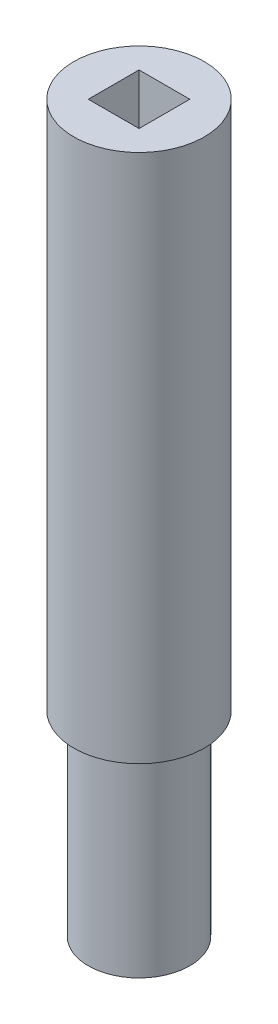
ISO-10303-21;
HEADER;
FILE_DESCRIPTION(('STEP AP214'),'2;1');
FILE_NAME('part.step','',(''),(''),'','','');
FILE_SCHEMA(('AUTOMOTIVE_DESIGN { 1 0 10303 214 1 1 1 1 }'));
ENDSEC;
DATA;
#1=APPLICATION_CONTEXT('core data for automotive mechanical design processes');
#2=APPLICATION_PROTOCOL_DEFINITION('international standard','automotive_design',2000,#1);
#3=PRODUCT_CONTEXT('',#1,'mechanical');
#4=PRODUCT('Part','Part','',(#3));
#5=PRODUCT_RELATED_PRODUCT_CATEGORY('part','',(#4));
#6=PRODUCT_DEFINITION_FORMATION('','',#4);
#7=PRODUCT_DEFINITION_CONTEXT('part definition',#1,'design');
#8=PRODUCT_DEFINITION('design','',#6,#7);
#9=PRODUCT_DEFINITION_SHAPE('','',#8);
#10=(LENGTH_UNIT() NAMED_UNIT(*) SI_UNIT(.MILLI.,.METRE.));
#11=(NAMED_UNIT(*) PLANE_ANGLE_UNIT() SI_UNIT($,.RADIAN.));
#12=(NAMED_UNIT(*) SI_UNIT($,.STERADIAN.) SOLID_ANGLE_UNIT());
#13=UNCERTAINTY_MEASURE_WITH_UNIT(LENGTH_MEASURE(1.E-05),#10,'distance_accuracy_value','');
#14=(GEOMETRIC_REPRESENTATION_CONTEXT(3) GLOBAL_UNCERTAINTY_ASSIGNED_CONTEXT((#13)) GLOBAL_UNIT_ASSIGNED_CONTEXT((#10,
#11,#12)) REPRESENTATION_CONTEXT('',''));
#15=CARTESIAN_POINT('',(0.,0.,0.));
#16=DIRECTION('',(0.,0.,1.));
#17=DIRECTION('',(1.,0.,0.));
#18=AXIS2_PLACEMENT_3D('',#15,#16,#17);
#19=CARTESIAN_POINT('',(0.,0.,0.));
#20=DIRECTION('',(0.,1.,0.));
#21=DIRECTION('',(0.,0.,1.));
#22=AXIS2_PLACEMENT_3D('',#19,#20,#21);
#23=PLANE('',#22);
#24=CARTESIAN_POINT('',(0.,0.,0.));
#25=DIRECTION('',(0.,-1.,0.));
#26=DIRECTION('',(0.,0.,-1.));
#27=AXIS2_PLACEMENT_3D('',#24,#25,#26);
#28=CIRCLE('',#27,7.);
#29=CARTESIAN_POINT('',(0.,0.,-7.));
#30=VERTEX_POINT('',#29);
#31=EDGE_CURVE('E170',#30,#30,#28,.T.);
#32=ORIENTED_EDGE('',*,*,#31,.T.);
#33=EDGE_LOOP('',(#32));
#34=FACE_BOUND('',#33,.T.);
#35=ADVANCED_FACE('F36',(#34),#23,.F.);
#36=CARTESIAN_POINT('',(0.,0.,0.));
#37=DIRECTION('',(0.,-1.,0.));
#38=DIRECTION('',(0.,0.,-1.));
#39=AXIS2_PLACEMENT_3D('',#36,#37,#38);
#40=CYLINDRICAL_SURFACE('',#39,7.);
#41=DIRECTION('',(0.,-1.,0.));
#42=VECTOR('',#41,1.);
#43=CARTESIAN_POINT('',(2.5,0.,-6.53834841531101));
#44=LINE('',#43,#42);
#45=CARTESIAN_POINT('',(2.5,4.,-6.53834841531101));
#46=VERTEX_POINT('',#45);
#47=CARTESIAN_POINT('',(2.5,22.,-6.53834841531101));
#48=VERTEX_POINT('',#47);
#49=EDGE_CURVE('E11',#46,#48,#44,.F.);
#50=ORIENTED_EDGE('',*,*,#49,.T.);
#51=CARTESIAN_POINT('',(2.5,22.,-6.53834841531101));
#52=CARTESIAN_POINT('',(2.50000932220903,22.0678892457289,-6.53833653785133));
#53=CARTESIAN_POINT('',(2.49723485076694,22.1357719326391,-6.53940549922738));
#54=CARTESIAN_POINT('',(2.4861910211816,22.2710039106114,-6.54361657478134));
#55=CARTESIAN_POINT('',(2.47792334551208,22.3383533586061,-6.54675805418062));
#56=CARTESIAN_POINT('',(2.456001752859,22.4718214146028,-6.55501217637942));
#57=CARTESIAN_POINT('',(2.44236559963955,22.5379433363398,-6.56011831705676));
#58=CARTESIAN_POINT('',(2.40985115466648,22.6687018351085,-6.57213177854175));
#59=CARTESIAN_POINT('',(2.39097263107436,22.7333383463124,-6.57903917900746));
#60=CARTESIAN_POINT('',(2.32673964179204,22.9242643664775,-6.6021493436571));
#61=CARTESIAN_POINT('',(2.27375112606986,23.0477904521356,-6.62075475340845));
#62=CARTESIAN_POINT('',(2.14910757865425,23.284230333128,-6.6622539736071));
#63=CARTESIAN_POINT('',(2.07743895048849,23.3971363167355,-6.68515090424876));
#64=CARTESIAN_POINT('',(1.9140257110197,23.6142152133527,-6.73379913792224));
#65=CARTESIAN_POINT('',(1.82158337146744,23.7178464751959,-6.75962864041371));
#66=CARTESIAN_POINT('',(1.6207338877633,23.9085087047164,-6.81057592323031));
#67=CARTESIAN_POINT('',(1.51232377552673,23.9955365792434,-6.83569357019868));
#68=CARTESIAN_POINT('',(1.27853915335934,24.153089855455,-6.88331133279046));
#69=CARTESIAN_POINT('',(1.15274833789185,24.2230315218605,-6.90570835223797));
#70=CARTESIAN_POINT('',(0.890250825476636,24.3405366467974,-6.94442357672633));
#71=CARTESIAN_POINT('',(0.753547890540328,24.388107779046,-6.96074386585465));
#72=CARTESIAN_POINT('',(0.478829979256176,24.4576406021824,-6.9849105051071));
#73=CARTESIAN_POINT('',(0.341079835227468,24.4805391304711,-6.99306594352515));
#74=CARTESIAN_POINT('',(0.0634643052969053,24.5030684027776,-7.00108798053822));
#75=CARTESIAN_POINT('',(-0.0764004845074468,24.5027055860346,-7.00095687302702));
#76=CARTESIAN_POINT('',(-0.347593258486944,24.4792887262389,-6.99262258049077));
#77=CARTESIAN_POINT('',(-0.479022407078719,24.4572552058015,-6.98478243583516));
#78=CARTESIAN_POINT('',(-0.736175812143607,24.3928265758412,-6.96237832507347));
#79=CARTESIAN_POINT('',(-0.861899745780463,24.3504303156375,-6.94781397899037));
#80=CARTESIAN_POINT('',(-1.10616102429807,24.2459530884347,-6.91316506890369));
#81=CARTESIAN_POINT('',(-1.22457279066906,24.1836042850399,-6.89300592164314));
#82=CARTESIAN_POINT('',(-1.44953531305523,24.0412206647766,-6.8492335561632));
#83=CARTESIAN_POINT('',(-1.5560824517677,23.9611804762164,-6.82561928959263));
#84=CARTESIAN_POINT('',(-1.7603244525607,23.7806767363433,-6.7759054780549));
#85=CARTESIAN_POINT('',(-1.85724185700418,23.6793502768551,-6.74974055843875));
#86=CARTESIAN_POINT('',(-2.03299914621296,23.4616726358344,-6.69890342468975));
#87=CARTESIAN_POINT('',(-2.11183255456462,23.3453160948315,-6.67423174765257));
#88=CARTESIAN_POINT('',(-2.25049860898459,23.098057401478,-6.62877803875405));
#89=CARTESIAN_POINT('',(-2.30994207989625,22.9669210244946,-6.60807875118994));
#90=CARTESIAN_POINT('',(-2.4055543972585,22.6956351984178,-6.57388213610267));
#91=CARTESIAN_POINT('',(-2.44176119399954,22.555500858831,-6.56037307165053));
#92=CARTESIAN_POINT('',(-2.47705497148627,22.3449694557358,-6.54708542245562));
#93=CARTESIAN_POINT('',(-2.48565347586445,22.2762636982282,-6.54382010967907));
#94=CARTESIAN_POINT('',(-2.49712352174882,22.1383848358083,-6.53944910829676));
#95=CARTESIAN_POINT('',(-2.50000139665367,22.0692123328995,-6.53834103140935));
#96=CARTESIAN_POINT('',(-2.5,22.,-6.53834841531101));
#97=B_SPLINE_CURVE_WITH_KNOTS('',3,(#51,#52,#53,#54,#55,#56,#57,#58,#59,#60,#61,#62,#63,#64,#65,
#66,#67,#68,#69,#70,#71,#72,#73,#74,#75,#76,#77,#78,#79,#80,#81,#82,#83,#84,#85,#86,#87,#88,#89,
#90,#91,#92,#93,#94,#95,#96),.UNSPECIFIED.,.F.,.F.,(4,2,2,2,2,2,2,2,2,2,2,2,2,2,2,2,2,2,2,2,2,2,
4),(0.,0.203591628551589,0.407120929225528,0.609982356545741,0.812852756635989,1.21793118555512,
1.6233052814847,2.0451597231193,2.4670926781184,2.90188398965561,3.33652604665238,
3.75400993940861,4.17137826416922,4.56998920861347,4.96862268086888,5.37284909448639,
5.77719841367921,6.20315837945088,6.6292706567472,7.06347329058504,7.49696496492444,
7.70468580162772,7.91217653896403),.UNSPECIFIED.);
#98=CARTESIAN_POINT('',(-2.5,22.,-6.53834841531101));
#99=VERTEX_POINT('',#98);
#100=EDGE_CURVE('E173',#48,#99,#97,.T.);
#101=ORIENTED_EDGE('',*,*,#100,.T.);
#102=DIRECTION('',(0.,-1.,0.));
#103=VECTOR('',#102,1.);
#104=CARTESIAN_POINT('',(-2.5,0.,-6.53834841531101));
#105=LINE('',#104,#103);
#106=CARTESIAN_POINT('',(-2.5,4.,-6.53834841531101));
#107=VERTEX_POINT('',#106);
#108=EDGE_CURVE('E43',#99,#107,#105,.T.);
#109=ORIENTED_EDGE('',*,*,#108,.T.);
#110=CARTESIAN_POINT('',(-2.5,4.,-6.53834841531101));
#111=CARTESIAN_POINT('',(-2.50000932220903,3.93211075427107,-6.53833653785133));
#112=CARTESIAN_POINT('',(-2.49723485076694,3.86422806736091,-6.53940549922738));
#113=CARTESIAN_POINT('',(-2.4861910211816,3.72899608938858,-6.54361657478134));
#114=CARTESIAN_POINT('',(-2.47792334551208,3.66164664139387,-6.54675805418062));
#115=CARTESIAN_POINT('',(-2.456001752859,3.52817858539721,-6.55501217637942));
#116=CARTESIAN_POINT('',(-2.44236559963955,3.46205666366019,-6.56011831705676));
#117=CARTESIAN_POINT('',(-2.40985115466648,3.33129816489153,-6.57213177854175));
#118=CARTESIAN_POINT('',(-2.39097263107435,3.26666165368758,-6.57903917900746));
#119=CARTESIAN_POINT('',(-2.32673964179204,3.07573563352248,-6.6021493436571));
#120=CARTESIAN_POINT('',(-2.27375112606986,2.95220954786442,-6.62075475340845));
#121=CARTESIAN_POINT('',(-2.14910757865425,2.71576966687203,-6.6622539736071));
#122=CARTESIAN_POINT('',(-2.07743895048849,2.60286368326447,-6.68515090424876));
#123=CARTESIAN_POINT('',(-1.9140257110197,2.38578478664729,-6.73379913792224));
#124=CARTESIAN_POINT('',(-1.82158337146744,2.28215352480412,-6.75962864041371));
#125=CARTESIAN_POINT('',(-1.6207338877633,2.09149129528357,-6.81057592323031));
#126=CARTESIAN_POINT('',(-1.51232377552673,2.00446342075665,-6.83569357019868));
#127=CARTESIAN_POINT('',(-1.27853915335934,1.84691014454501,-6.88331133279046));
#128=CARTESIAN_POINT('',(-1.15274833789185,1.77696847813946,-6.90570835223797));
#129=CARTESIAN_POINT('',(-0.890250825476635,1.6594633532026,-6.94442357672633));
#130=CARTESIAN_POINT('',(-0.753547890540326,1.61189222095399,-6.96074386585465));
#131=CARTESIAN_POINT('',(-0.478829979256174,1.54235939781764,-6.9849105051071));
#132=CARTESIAN_POINT('',(-0.341079835227466,1.51946086952892,-6.99306594352515));
#133=CARTESIAN_POINT('',(-0.0634643052969031,1.49693159722236,-7.00108798053822));
#134=CARTESIAN_POINT('',(0.0764004845074488,1.49729441396535,-7.00095687302702));
#135=CARTESIAN_POINT('',(0.347593258486946,1.52071127376112,-6.99262258049077));
#136=CARTESIAN_POINT('',(0.47902240707872,1.54274479419853,-6.98478243583516));
#137=CARTESIAN_POINT('',(0.736175812143607,1.6071734241588,-6.96237832507347));
#138=CARTESIAN_POINT('',(0.861899745780464,1.64956968436252,-6.94781397899037));
#139=CARTESIAN_POINT('',(1.10616102429807,1.75404691156532,-6.91316506890369));
#140=CARTESIAN_POINT('',(1.22457279066906,1.81639571496012,-6.89300592164314));
#141=CARTESIAN_POINT('',(1.44953531305523,1.95877933522336,-6.8492335561632));
#142=CARTESIAN_POINT('',(1.5560824517677,2.03881952378359,-6.82561928959263));
#143=CARTESIAN_POINT('',(1.7603244525607,2.2193232636567,-6.7759054780549));
#144=CARTESIAN_POINT('',(1.85724185700418,2.3206497231449,-6.74974055843875));
#145=CARTESIAN_POINT('',(2.03299914621296,2.53832736416557,-6.69890342468975));
#146=CARTESIAN_POINT('',(2.11183255456462,2.65468390516847,-6.67423174765257));
#147=CARTESIAN_POINT('',(2.25049860898459,2.90194259852198,-6.62877803875405));
#148=CARTESIAN_POINT('',(2.30994207989625,3.03307897550541,-6.60807875118994));
#149=CARTESIAN_POINT('',(2.4055543972585,3.30436480158219,-6.57388213610267));
#150=CARTESIAN_POINT('',(2.44176119399954,3.44449914116898,-6.56037307165053));
#151=CARTESIAN_POINT('',(2.47705497148627,3.65503054426421,-6.54708542245562));
#152=CARTESIAN_POINT('',(2.48565347586445,3.72373630177179,-6.54382010967907));
#153=CARTESIAN_POINT('',(2.49712352174882,3.86161516419169,-6.53944910829676));
#154=CARTESIAN_POINT('',(2.50000139665367,3.93078766710051,-6.53834103140935));
#155=CARTESIAN_POINT('',(2.5,4.,-6.53834841531101));
#156=B_SPLINE_CURVE_WITH_KNOTS('',3,(#110,#111,#112,#113,#114,#115,#116,#117,#118,#119,#120,
#121,#122,#123,#124,#125,#126,#127,#128,#129,#130,#131,#132,#133,#134,#135,#136,#137,#138,#139,
#140,#141,#142,#143,#144,#145,#146,#147,#148,#149,#150,#151,#152,#153,#154,#155),.UNSPECIFIED.,
.F.,.F.,(4,2,2,2,2,2,2,2,2,2,2,2,2,2,2,2,2,2,2,2,2,2,4),(0.,0.203591628551591,0.40712092922553,
0.609982356545741,0.812852756635989,1.21793118555512,1.6233052814847,2.0451597231193,
2.4670926781184,2.90188398965561,3.33652604665238,3.75400993940861,4.17137826416922,
4.56998920861347,4.96862268086888,5.37284909448639,5.77719841367921,6.20315837945088,
6.62927065674721,7.06347329058505,7.49696496492444,7.70468580162773,7.91217653896403),.UNSPECIFIED.);
#157=EDGE_CURVE('E50',#107,#46,#156,.T.);
#158=ORIENTED_EDGE('',*,*,#157,.T.);
#159=EDGE_LOOP('',(#50,#101,#109,#158));
#160=FACE_BOUND('',#159,.T.);
#161=ORIENTED_EDGE('',*,*,#31,.F.);
#162=EDGE_LOOP('',(#161));
#163=FACE_BOUND('',#162,.T.);
#164=CARTESIAN_POINT('',(0.,27.,0.));
#165=DIRECTION('',(0.,-1.,0.));
#166=DIRECTION('',(0.,0.,-1.));
#167=AXIS2_PLACEMENT_3D('',#164,#165,#166);
#168=CIRCLE('',#167,7.);
#169=CARTESIAN_POINT('',(0.,27.,-7.));
#170=VERTEX_POINT('',#169);
#171=EDGE_CURVE('E167',#170,#170,#168,.T.);
#172=ORIENTED_EDGE('',*,*,#171,.T.);
#173=EDGE_LOOP('',(#172));
#174=FACE_BOUND('',#173,.T.);
#175=ADVANCED_FACE('F184',(#160,#163,#174),#40,.T.);
#176=CARTESIAN_POINT('',(-7.,27.,0.));
#177=DIRECTION('',(0.,1.,0.));
#178=DIRECTION('',(0.,0.,1.));
#179=AXIS2_PLACEMENT_3D('',#176,#177,#178);
#180=PLANE('',#179);
#181=ORIENTED_EDGE('',*,*,#171,.F.);
#182=EDGE_LOOP('',(#181));
#183=FACE_BOUND('',#182,.T.);
#184=CARTESIAN_POINT('',(0.,27.,0.));
#185=DIRECTION('',(0.,-1.,0.));
#186=DIRECTION('',(0.,0.,-1.));
#187=AXIS2_PLACEMENT_3D('',#184,#185,#186);
#188=CIRCLE('',#187,9.);
#189=CARTESIAN_POINT('',(0.,27.,-9.));
#190=VERTEX_POINT('',#189);
#191=EDGE_CURVE('E164',#190,#190,#188,.T.);
#192=ORIENTED_EDGE('',*,*,#191,.T.);
#193=EDGE_LOOP('',(#192));
#194=FACE_BOUND('',#193,.T.);
#195=ADVANCED_FACE('F224',(#183,#194),#180,.F.);
#196=CARTESIAN_POINT('',(0.,0.,0.));
#197=DIRECTION('',(0.,-1.,0.));
#198=DIRECTION('',(0.,0.,-1.));
#199=AXIS2_PLACEMENT_3D('',#196,#197,#198);
#200=CYLINDRICAL_SURFACE('',#199,9.);
#201=ORIENTED_EDGE('',*,*,#191,.F.);
#202=EDGE_LOOP('',(#201));
#203=FACE_BOUND('',#202,.T.);
#204=CARTESIAN_POINT('',(0.,100.,0.));
#205=DIRECTION('',(0.,-1.,0.));
#206=DIRECTION('',(0.,0.,-1.));
#207=AXIS2_PLACEMENT_3D('',#204,#205,#206);
#208=CIRCLE('',#207,9.);
#209=CARTESIAN_POINT('',(0.,100.,-9.));
#210=VERTEX_POINT('',#209);
#211=EDGE_CURVE('E156',#210,#210,#208,.T.);
#212=ORIENTED_EDGE('',*,*,#211,.T.);
#213=EDGE_LOOP('',(#212));
#214=FACE_BOUND('',#213,.T.);
#215=ADVANCED_FACE('F221',(#203,#214),#200,.T.);
#216=CARTESIAN_POINT('',(0.,100.,0.));
#217=DIRECTION('',(0.,-1.,0.));
#218=DIRECTION('',(0.,0.,-1.));
#219=AXIS2_PLACEMENT_3D('',#216,#217,#218);
#220=PLANE('',#219);
#221=DIRECTION('',(-1.,0.,0.));
#222=VECTOR('',#221,1.);
#223=CARTESIAN_POINT('',(-3.5,100.,-3.5));
#224=LINE('',#223,#222);
#225=CARTESIAN_POINT('',(3.5,100.,-3.5));
#226=VERTEX_POINT('',#225);
#227=CARTESIAN_POINT('',(-3.5,100.,-3.5));
#228=VERTEX_POINT('',#227);
#229=EDGE_CURVE('E146',#226,#228,#224,.T.);
#230=ORIENTED_EDGE('',*,*,#229,.F.);
#231=DIRECTION('',(0.,0.,-1.));
#232=VECTOR('',#231,1.);
#233=CARTESIAN_POINT('',(3.5,100.,3.5));
#234=LINE('',#233,#232);
#235=CARTESIAN_POINT('',(3.5,100.,3.5));
#236=VERTEX_POINT('',#235);
#237=EDGE_CURVE('E58',#236,#226,#234,.T.);
#238=ORIENTED_EDGE('',*,*,#237,.F.);
#239=DIRECTION('',(1.,0.,0.));
#240=VECTOR('',#239,1.);
#241=CARTESIAN_POINT('',(-3.5,100.,3.5));
#242=LINE('',#241,#240);
#243=CARTESIAN_POINT('',(-3.5,100.,3.5));
#244=VERTEX_POINT('',#243);
#245=EDGE_CURVE('E135',#244,#236,#242,.T.);
#246=ORIENTED_EDGE('',*,*,#245,.F.);
#247=DIRECTION('',(0.,0.,1.));
#248=VECTOR('',#247,1.);
#249=CARTESIAN_POINT('',(-3.5,100.,3.5));
#250=LINE('',#249,#248);
#251=EDGE_CURVE('E149',#228,#244,#250,.T.);
#252=ORIENTED_EDGE('',*,*,#251,.F.);
#253=EDGE_LOOP('',(#230,#238,#246,#252));
#254=FACE_BOUND('',#253,.T.);
#255=ORIENTED_EDGE('',*,*,#211,.F.);
#256=EDGE_LOOP('',(#255));
#257=FACE_BOUND('',#256,.T.);
#258=ADVANCED_FACE('F218',(#254,#257),#220,.F.);
#259=CARTESIAN_POINT('',(3.5,65.,3.5));
#260=DIRECTION('',(1.,0.,0.));
#261=DIRECTION('',(0.,0.,-1.));
#262=AXIS2_PLACEMENT_3D('',#259,#260,#261);
#263=PLANE('',#262);
#264=ORIENTED_EDGE('',*,*,#237,.T.);
#265=DIRECTION('',(0.,1.,0.));
#266=VECTOR('',#265,1.);
#267=CARTESIAN_POINT('',(3.5,65.,-3.5));
#268=LINE('',#267,#266);
#269=CARTESIAN_POINT('',(3.5,65.,-3.5));
#270=VERTEX_POINT('',#269);
#271=EDGE_CURVE('E144',#270,#226,#268,.T.);
#272=ORIENTED_EDGE('',*,*,#271,.F.);
#273=DIRECTION('',(0.,0.,-1.));
#274=VECTOR('',#273,1.);
#275=CARTESIAN_POINT('',(3.5,65.,3.5));
#276=LINE('',#275,#274);
#277=CARTESIAN_POINT('',(3.5,65.,3.5));
#278=VERTEX_POINT('',#277);
#279=EDGE_CURVE('E131',#278,#270,#276,.T.);
#280=ORIENTED_EDGE('',*,*,#279,.F.);
#281=DIRECTION('',(0.,1.,0.));
#282=VECTOR('',#281,1.);
#283=CARTESIAN_POINT('',(3.5,65.,3.5));
#284=LINE('',#283,#282);
#285=EDGE_CURVE('E154',#278,#236,#284,.T.);
#286=ORIENTED_EDGE('',*,*,#285,.T.);
#287=EDGE_LOOP('',(#264,#272,#280,#286));
#288=FACE_BOUND('',#287,.T.);
#289=ADVANCED_FACE('F208',(#288),#263,.F.);
#290=CARTESIAN_POINT('',(-3.5,65.,3.5));
#291=DIRECTION('',(0.,0.,1.));
#292=DIRECTION('',(1.,0.,0.));
#293=AXIS2_PLACEMENT_3D('',#290,#291,#292);
#294=PLANE('',#293);
#295=ORIENTED_EDGE('',*,*,#245,.T.);
#296=ORIENTED_EDGE('',*,*,#285,.F.);
#297=DIRECTION('',(1.,0.,0.));
#298=VECTOR('',#297,1.);
#299=CARTESIAN_POINT('',(-3.5,65.,3.5));
#300=LINE('',#299,#298);
#301=CARTESIAN_POINT('',(-3.5,65.,3.5));
#302=VERTEX_POINT('',#301);
#303=EDGE_CURVE('E141',#302,#278,#300,.T.);
#304=ORIENTED_EDGE('',*,*,#303,.F.);
#305=DIRECTION('',(0.,1.,0.));
#306=VECTOR('',#305,1.);
#307=CARTESIAN_POINT('',(-3.5,65.,3.5));
#308=LINE('',#307,#306);
#309=EDGE_CURVE('E157',#302,#244,#308,.T.);
#310=ORIENTED_EDGE('',*,*,#309,.T.);
#311=EDGE_LOOP('',(#295,#296,#304,#310));
#312=FACE_BOUND('',#311,.T.);
#313=ADVANCED_FACE('F204',(#312),#294,.F.);
#314=CARTESIAN_POINT('',(-3.5,65.,3.5));
#315=DIRECTION('',(-1.,0.,0.));
#316=DIRECTION('',(0.,0.,1.));
#317=AXIS2_PLACEMENT_3D('',#314,#315,#316);
#318=PLANE('',#317);
#319=ORIENTED_EDGE('',*,*,#251,.T.);
#320=ORIENTED_EDGE('',*,*,#309,.F.);
#321=DIRECTION('',(0.,0.,1.));
#322=VECTOR('',#321,1.);
#323=CARTESIAN_POINT('',(-3.5,65.,3.5));
#324=LINE('',#323,#322);
#325=CARTESIAN_POINT('',(-3.5,65.,-3.5));
#326=VERTEX_POINT('',#325);
#327=EDGE_CURVE('E138',#326,#302,#324,.T.);
#328=ORIENTED_EDGE('',*,*,#327,.F.);
#329=DIRECTION('',(0.,1.,0.));
#330=VECTOR('',#329,1.);
#331=CARTESIAN_POINT('',(-3.5,65.,-3.5));
#332=LINE('',#331,#330);
#333=EDGE_CURVE('E159',#326,#228,#332,.T.);
#334=ORIENTED_EDGE('',*,*,#333,.T.);
#335=EDGE_LOOP('',(#319,#320,#328,#334));
#336=FACE_BOUND('',#335,.T.);
#337=ADVANCED_FACE('F207',(#336),#318,.F.);
#338=CARTESIAN_POINT('',(-3.5,65.,-3.5));
#339=DIRECTION('',(0.,0.,-1.));
#340=DIRECTION('',(-1.,0.,0.));
#341=AXIS2_PLACEMENT_3D('',#338,#339,#340);
#342=PLANE('',#341);
#343=ORIENTED_EDGE('',*,*,#229,.T.);
#344=ORIENTED_EDGE('',*,*,#333,.F.);
#345=DIRECTION('',(-1.,0.,0.));
#346=VECTOR('',#345,1.);
#347=CARTESIAN_POINT('',(-3.5,65.,-3.5));
#348=LINE('',#347,#346);
#349=EDGE_CURVE('E134',#270,#326,#348,.T.);
#350=ORIENTED_EDGE('',*,*,#349,.F.);
#351=ORIENTED_EDGE('',*,*,#271,.T.);
#352=EDGE_LOOP('',(#343,#344,#350,#351));
#353=FACE_BOUND('',#352,.T.);
#354=ADVANCED_FACE('F202',(#353),#342,.F.);
#355=CARTESIAN_POINT('',(0.,65.,0.));
#356=DIRECTION('',(0.,-1.,0.));
#357=DIRECTION('',(0.,0.,-1.));
#358=AXIS2_PLACEMENT_3D('',#355,#356,#357);
#359=PLANE('',#358);
#360=ORIENTED_EDGE('',*,*,#279,.T.);
#361=ORIENTED_EDGE('',*,*,#349,.T.);
#362=ORIENTED_EDGE('',*,*,#327,.T.);
#363=ORIENTED_EDGE('',*,*,#303,.T.);
#364=EDGE_LOOP('',(#360,#361,#362,#363));
#365=FACE_BOUND('',#364,.T.);
#366=ADVANCED_FACE('F199',(#365),#359,.F.);
#367=CARTESIAN_POINT('',(0.,4.,-4.));
#368=DIRECTION('',(0.,0.,-1.));
#369=DIRECTION('',(-1.,0.,0.));
#370=AXIS2_PLACEMENT_3D('',#367,#368,#369);
#371=CYLINDRICAL_SURFACE('',#370,2.5);
#372=DIRECTION('',(0.,0.,-1.));
#373=VECTOR('',#372,1.);
#374=CARTESIAN_POINT('',(-2.5,4.,-4.));
#375=LINE('',#374,#373);
#376=CARTESIAN_POINT('',(-2.5,4.,-4.));
#377=VERTEX_POINT('',#376);
#378=EDGE_CURVE('E99',#377,#107,#375,.T.);
#379=ORIENTED_EDGE('',*,*,#378,.F.);
#380=CARTESIAN_POINT('',(0.,4.,-4.));
#381=DIRECTION('',(0.,0.,-1.));
#382=DIRECTION('',(-1.,0.,0.));
#383=AXIS2_PLACEMENT_3D('',#380,#381,#382);
#384=CIRCLE('',#383,2.5);
#385=CARTESIAN_POINT('',(2.5,4.,-4.));
#386=VERTEX_POINT('',#385);
#387=EDGE_CURVE('E103',#386,#377,#384,.T.);
#388=ORIENTED_EDGE('',*,*,#387,.F.);
#389=DIRECTION('',(0.,0.,-1.));
#390=VECTOR('',#389,1.);
#391=CARTESIAN_POINT('',(2.5,4.,-4.));
#392=LINE('',#391,#390);
#393=EDGE_CURVE('E125',#386,#46,#392,.T.);
#394=ORIENTED_EDGE('',*,*,#393,.T.);
#395=ORIENTED_EDGE('',*,*,#157,.F.);
#396=EDGE_LOOP('',(#379,#388,#394,#395));
#397=FACE_BOUND('',#396,.T.);
#398=ADVANCED_FACE('F101',(#397),#371,.F.);
#399=CARTESIAN_POINT('',(2.5,4.,-4.));
#400=DIRECTION('',(1.,0.,0.));
#401=DIRECTION('',(0.,0.,-1.));
#402=AXIS2_PLACEMENT_3D('',#399,#400,#401);
#403=PLANE('',#402);
#404=ORIENTED_EDGE('',*,*,#393,.F.);
#405=DIRECTION('',(0.,-1.,0.));
#406=VECTOR('',#405,1.);
#407=CARTESIAN_POINT('',(2.5,4.,-4.));
#408=LINE('',#407,#406);
#409=CARTESIAN_POINT('',(2.5,22.,-4.));
#410=VERTEX_POINT('',#409);
#411=EDGE_CURVE('E108',#410,#386,#408,.T.);
#412=ORIENTED_EDGE('',*,*,#411,.F.);
#413=DIRECTION('',(0.,0.,-1.));
#414=VECTOR('',#413,1.);
#415=CARTESIAN_POINT('',(2.5,22.,-4.));
#416=LINE('',#415,#414);
#417=EDGE_CURVE('E127',#410,#48,#416,.T.);
#418=ORIENTED_EDGE('',*,*,#417,.T.);
#419=ORIENTED_EDGE('',*,*,#49,.F.);
#420=EDGE_LOOP('',(#404,#412,#418,#419));
#421=FACE_BOUND('',#420,.T.);
#422=ADVANCED_FACE('F192',(#421),#403,.F.);
#423=CARTESIAN_POINT('',(0.,22.,-4.));
#424=DIRECTION('',(0.,0.,-1.));
#425=DIRECTION('',(-1.,0.,0.));
#426=AXIS2_PLACEMENT_3D('',#423,#424,#425);
#427=CYLINDRICAL_SURFACE('',#426,2.5);
#428=ORIENTED_EDGE('',*,*,#417,.F.);
#429=CARTESIAN_POINT('',(0.,22.,-4.));
#430=DIRECTION('',(0.,0.,-1.));
#431=DIRECTION('',(-1.,0.,0.));
#432=AXIS2_PLACEMENT_3D('',#429,#430,#431);
#433=CIRCLE('',#432,2.5);
#434=CARTESIAN_POINT('',(-2.5,22.,-4.));
#435=VERTEX_POINT('',#434);
#436=EDGE_CURVE('E117',#435,#410,#433,.T.);
#437=ORIENTED_EDGE('',*,*,#436,.F.);
#438=DIRECTION('',(0.,0.,-1.));
#439=VECTOR('',#438,1.);
#440=CARTESIAN_POINT('',(-2.5,22.,-4.));
#441=LINE('',#440,#439);
#442=EDGE_CURVE('E107',#435,#99,#441,.T.);
#443=ORIENTED_EDGE('',*,*,#442,.T.);
#444=ORIENTED_EDGE('',*,*,#100,.F.);
#445=EDGE_LOOP('',(#428,#437,#443,#444));
#446=FACE_BOUND('',#445,.T.);
#447=ADVANCED_FACE('F187',(#446),#427,.F.);
#448=CARTESIAN_POINT('',(-2.5,4.,-4.));
#449=DIRECTION('',(-1.,0.,0.));
#450=DIRECTION('',(0.,0.,1.));
#451=AXIS2_PLACEMENT_3D('',#448,#449,#450);
#452=PLANE('',#451);
#453=ORIENTED_EDGE('',*,*,#442,.F.);
#454=DIRECTION('',(0.,1.,0.));
#455=VECTOR('',#454,1.);
#456=CARTESIAN_POINT('',(-2.5,4.,-4.));
#457=LINE('',#456,#455);
#458=EDGE_CURVE('E111',#377,#435,#457,.T.);
#459=ORIENTED_EDGE('',*,*,#458,.F.);
#460=ORIENTED_EDGE('',*,*,#378,.T.);
#461=ORIENTED_EDGE('',*,*,#108,.F.);
#462=EDGE_LOOP('',(#453,#459,#460,#461));
#463=FACE_BOUND('',#462,.T.);
#464=ADVANCED_FACE('F112',(#463),#452,.F.);
#465=CARTESIAN_POINT('',(0.,4.,-4.));
#466=DIRECTION('',(0.,0.,-1.));
#467=DIRECTION('',(-1.,0.,0.));
#468=AXIS2_PLACEMENT_3D('',#465,#466,#467);
#469=PLANE('',#468);
#470=ORIENTED_EDGE('',*,*,#387,.T.);
#471=ORIENTED_EDGE('',*,*,#458,.T.);
#472=ORIENTED_EDGE('',*,*,#436,.T.);
#473=ORIENTED_EDGE('',*,*,#411,.T.);
#474=EDGE_LOOP('',(#470,#471,#472,#473));
#475=FACE_BOUND('',#474,.T.);
#476=ADVANCED_FACE('F119',(#475),#469,.T.);
#477=CLOSED_SHELL('',(#35,#175,#195,#215,#258,#289,#313,#337,#354,#366,#398,#422,#447,#464,#476));
#478=MANIFOLD_SOLID_BREP('B2',#477);
#479=ADVANCED_BREP_SHAPE_REPRESENTATION('',(#18,#478),#14);
#480=SHAPE_DEFINITION_REPRESENTATION(#9,#479);
ENDSEC;
END-ISO-10303-21;
